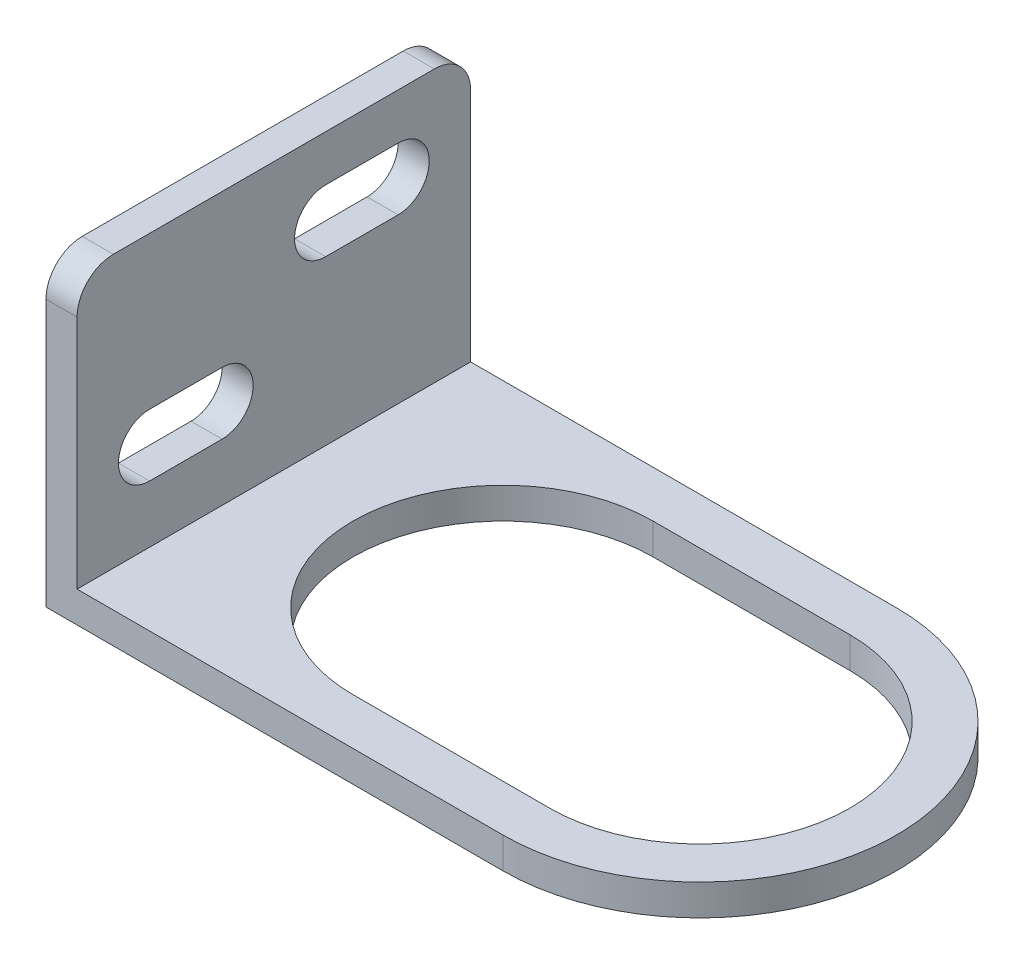
ISO-10303-21;
HEADER;
FILE_DESCRIPTION(('STEP AP214'),'2;1');
FILE_NAME('part.step','',(''),(''),'','','');
FILE_SCHEMA(('AUTOMOTIVE_DESIGN { 1 0 10303 214 1 1 1 1 }'));
ENDSEC;
DATA;
#1=APPLICATION_CONTEXT('core data for automotive mechanical design processes');
#2=APPLICATION_PROTOCOL_DEFINITION('international standard','automotive_design',2000,#1);
#3=PRODUCT_CONTEXT('',#1,'mechanical');
#4=PRODUCT('Part','Part','',(#3));
#5=PRODUCT_RELATED_PRODUCT_CATEGORY('part','',(#4));
#6=PRODUCT_DEFINITION_FORMATION('','',#4);
#7=PRODUCT_DEFINITION_CONTEXT('part definition',#1,'design');
#8=PRODUCT_DEFINITION('design','',#6,#7);
#9=PRODUCT_DEFINITION_SHAPE('','',#8);
#10=(LENGTH_UNIT() NAMED_UNIT(*) SI_UNIT(.MILLI.,.METRE.));
#11=(NAMED_UNIT(*) PLANE_ANGLE_UNIT() SI_UNIT($,.RADIAN.));
#12=(NAMED_UNIT(*) SI_UNIT($,.STERADIAN.) SOLID_ANGLE_UNIT());
#13=UNCERTAINTY_MEASURE_WITH_UNIT(LENGTH_MEASURE(1.E-05),#10,'distance_accuracy_value','');
#14=(GEOMETRIC_REPRESENTATION_CONTEXT(3) GLOBAL_UNCERTAINTY_ASSIGNED_CONTEXT((#13)) GLOBAL_UNIT_ASSIGNED_CONTEXT((#10,
#11,#12)) REPRESENTATION_CONTEXT('',''));
#15=CARTESIAN_POINT('',(0.,0.,0.));
#16=DIRECTION('',(0.,0.,1.));
#17=DIRECTION('',(1.,0.,0.));
#18=AXIS2_PLACEMENT_3D('',#15,#16,#17);
#19=CARTESIAN_POINT('',(0.,0.,19.));
#20=DIRECTION('',(0.,0.,-1.));
#21=DIRECTION('',(-1.,0.,0.));
#22=AXIS2_PLACEMENT_3D('',#19,#20,#21);
#23=PLANE('',#22);
#24=DIRECTION('',(0.,1.,0.));
#25=VECTOR('',#24,1.);
#26=CARTESIAN_POINT('',(42.625671960899,-8.5,19.));
#27=LINE('',#26,#25);
#28=CARTESIAN_POINT('',(42.625671960899,-1.5,19.));
#29=VERTEX_POINT('',#28);
#30=CARTESIAN_POINT('',(42.625671960899,1.5,19.));
#31=VERTEX_POINT('',#30);
#32=EDGE_CURVE('E183',#29,#31,#27,.T.);
#33=ORIENTED_EDGE('',*,*,#32,.T.);
#34=DIRECTION('',(1.,0.,0.));
#35=VECTOR('',#34,1.);
#36=CARTESIAN_POINT('',(0.,1.5,19.));
#37=LINE('',#36,#35);
#38=CARTESIAN_POINT('',(1.5,1.5,19.));
#39=VERTEX_POINT('',#38);
#40=EDGE_CURVE('E182',#39,#31,#37,.T.);
#41=ORIENTED_EDGE('',*,*,#40,.F.);
#42=DIRECTION('',(0.,-1.,0.));
#43=VECTOR('',#42,1.);
#44=CARTESIAN_POINT('',(1.5,32.,19.));
#45=LINE('',#44,#43);
#46=CARTESIAN_POINT('',(1.5,24.2461484812615,19.));
#47=VERTEX_POINT('',#46);
#48=EDGE_CURVE('E209',#47,#39,#45,.T.);
#49=ORIENTED_EDGE('',*,*,#48,.F.);
#50=DIRECTION('',(1.,0.,0.));
#51=VECTOR('',#50,1.);
#52=CARTESIAN_POINT('',(-1.5,24.2461484812615,19.));
#53=LINE('',#52,#51);
#54=CARTESIAN_POINT('',(-1.5,24.2461484812615,19.));
#55=VERTEX_POINT('',#54);
#56=EDGE_CURVE('E220',#55,#47,#53,.T.);
#57=ORIENTED_EDGE('',*,*,#56,.F.);
#58=DIRECTION('',(0.,-1.,0.));
#59=VECTOR('',#58,1.);
#60=CARTESIAN_POINT('',(-1.5,32.,19.));
#61=LINE('',#60,#59);
#62=CARTESIAN_POINT('',(-1.5,-1.5,19.));
#63=VERTEX_POINT('',#62);
#64=EDGE_CURVE('E202',#55,#63,#61,.T.);
#65=ORIENTED_EDGE('',*,*,#64,.T.);
#66=DIRECTION('',(1.,0.,0.));
#67=VECTOR('',#66,1.);
#68=CARTESIAN_POINT('',(0.,-1.5,19.));
#69=LINE('',#68,#67);
#70=EDGE_CURVE('E199',#63,#29,#69,.T.);
#71=ORIENTED_EDGE('',*,*,#70,.T.);
#72=EDGE_LOOP('',(#33,#41,#49,#57,#65,#71));
#73=FACE_BOUND('',#72,.T.);
#74=ADVANCED_FACE('F33',(#73),#23,.F.);
#75=CARTESIAN_POINT('',(0.,0.,-19.));
#76=DIRECTION('',(0.,0.,-1.));
#77=DIRECTION('',(-1.,0.,0.));
#78=AXIS2_PLACEMENT_3D('',#75,#76,#77);
#79=PLANE('',#78);
#80=DIRECTION('',(1.,0.,0.));
#81=VECTOR('',#80,1.);
#82=CARTESIAN_POINT('',(0.,1.5,-19.));
#83=LINE('',#82,#81);
#84=CARTESIAN_POINT('',(1.5,1.5,-19.));
#85=VERTEX_POINT('',#84);
#86=CARTESIAN_POINT('',(42.625671960899,1.5,-19.));
#87=VERTEX_POINT('',#86);
#88=EDGE_CURVE('E180',#85,#87,#83,.T.);
#89=ORIENTED_EDGE('',*,*,#88,.T.);
#90=DIRECTION('',(0.,1.,0.));
#91=VECTOR('',#90,1.);
#92=CARTESIAN_POINT('',(42.625671960899,-8.5,-19.));
#93=LINE('',#92,#91);
#94=CARTESIAN_POINT('',(42.625671960899,-1.5,-19.));
#95=VERTEX_POINT('',#94);
#96=EDGE_CURVE('E11',#87,#95,#93,.F.);
#97=ORIENTED_EDGE('',*,*,#96,.T.);
#98=DIRECTION('',(1.,0.,0.));
#99=VECTOR('',#98,1.);
#100=CARTESIAN_POINT('',(0.,-1.5,-19.));
#101=LINE('',#100,#99);
#102=CARTESIAN_POINT('',(-1.5,-1.5,-19.));
#103=VERTEX_POINT('',#102);
#104=EDGE_CURVE('E190',#103,#95,#101,.T.);
#105=ORIENTED_EDGE('',*,*,#104,.F.);
#106=DIRECTION('',(0.,-1.,0.));
#107=VECTOR('',#106,1.);
#108=CARTESIAN_POINT('',(-1.5,32.,-19.));
#109=LINE('',#108,#107);
#110=CARTESIAN_POINT('',(-1.5,24.2461484812615,-19.));
#111=VERTEX_POINT('',#110);
#112=EDGE_CURVE('E192',#111,#103,#109,.T.);
#113=ORIENTED_EDGE('',*,*,#112,.F.);
#114=DIRECTION('',(1.,0.,0.));
#115=VECTOR('',#114,1.);
#116=CARTESIAN_POINT('',(-1.5,24.2461484812615,-19.));
#117=LINE('',#116,#115);
#118=CARTESIAN_POINT('',(1.5,24.2461484812615,-19.));
#119=VERTEX_POINT('',#118);
#120=EDGE_CURVE('E275',#111,#119,#117,.T.);
#121=ORIENTED_EDGE('',*,*,#120,.T.);
#122=DIRECTION('',(0.,-1.,0.));
#123=VECTOR('',#122,1.);
#124=CARTESIAN_POINT('',(1.5,32.,-19.));
#125=LINE('',#124,#123);
#126=EDGE_CURVE('E188',#119,#85,#125,.T.);
#127=ORIENTED_EDGE('',*,*,#126,.T.);
#128=EDGE_LOOP('',(#89,#97,#105,#113,#121,#127));
#129=FACE_BOUND('',#128,.T.);
#130=ADVANCED_FACE('F185',(#129),#79,.T.);
#131=CARTESIAN_POINT('',(0.,-1.5,19.));
#132=DIRECTION('',(0.,1.,0.));
#133=DIRECTION('',(0.,0.,1.));
#134=AXIS2_PLACEMENT_3D('',#131,#132,#133);
#135=PLANE('',#134);
#136=DIRECTION('',(1.,0.,0.));
#137=VECTOR('',#136,1.);
#138=CARTESIAN_POINT('',(0.,-1.5,14.5));
#139=LINE('',#138,#137);
#140=CARTESIAN_POINT('',(23.6256719608991,-1.5,14.5));
#141=VERTEX_POINT('',#140);
#142=CARTESIAN_POINT('',(42.6256719608991,-1.5,14.5));
#143=VERTEX_POINT('',#142);
#144=EDGE_CURVE('E255',#141,#143,#139,.T.);
#145=ORIENTED_EDGE('',*,*,#144,.T.);
#146=CARTESIAN_POINT('',(42.6256719608991,-1.5,0.));
#147=DIRECTION('',(0.,1.,0.));
#148=DIRECTION('',(0.,0.,1.));
#149=AXIS2_PLACEMENT_3D('',#146,#147,#148);
#150=CIRCLE('',#149,14.5);
#151=CARTESIAN_POINT('',(42.6256719608991,-1.5,-14.5));
#152=VERTEX_POINT('',#151);
#153=EDGE_CURVE('E258',#143,#152,#150,.T.);
#154=ORIENTED_EDGE('',*,*,#153,.T.);
#155=DIRECTION('',(-1.,0.,0.));
#156=VECTOR('',#155,1.);
#157=CARTESIAN_POINT('',(0.,-1.5,-14.5));
#158=LINE('',#157,#156);
#159=CARTESIAN_POINT('',(23.6256719608991,-1.5,-14.5));
#160=VERTEX_POINT('',#159);
#161=EDGE_CURVE('E244',#152,#160,#158,.T.);
#162=ORIENTED_EDGE('',*,*,#161,.T.);
#163=CARTESIAN_POINT('',(23.6256719608991,-1.5,0.));
#164=DIRECTION('',(0.,1.,0.));
#165=DIRECTION('',(0.,0.,1.));
#166=AXIS2_PLACEMENT_3D('',#163,#164,#165);
#167=CIRCLE('',#166,14.5);
#168=EDGE_CURVE('E252',#160,#141,#167,.T.);
#169=ORIENTED_EDGE('',*,*,#168,.T.);
#170=EDGE_LOOP('',(#145,#154,#162,#169));
#171=FACE_BOUND('',#170,.T.);
#172=ORIENTED_EDGE('',*,*,#104,.T.);
#173=CARTESIAN_POINT('',(42.625671960899,-1.5,0.));
#174=DIRECTION('',(0.,1.,0.));
#175=DIRECTION('',(0.,0.,1.));
#176=AXIS2_PLACEMENT_3D('',#173,#174,#175);
#177=CIRCLE('',#176,19.);
#178=EDGE_CURVE('E48',#95,#29,#177,.F.);
#179=ORIENTED_EDGE('',*,*,#178,.T.);
#180=ORIENTED_EDGE('',*,*,#70,.F.);
#181=DIRECTION('',(0.,0.,-1.));
#182=VECTOR('',#181,1.);
#183=CARTESIAN_POINT('',(-1.5,-1.5,19.));
#184=LINE('',#183,#182);
#185=EDGE_CURVE('E200',#63,#103,#184,.T.);
#186=ORIENTED_EDGE('',*,*,#185,.T.);
#187=EDGE_LOOP('',(#172,#179,#180,#186));
#188=FACE_BOUND('',#187,.T.);
#189=ADVANCED_FACE('F35',(#171,#188),#135,.F.);
#190=CARTESIAN_POINT('',(0.,1.5,19.));
#191=DIRECTION('',(0.,1.,0.));
#192=DIRECTION('',(0.,0.,1.));
#193=AXIS2_PLACEMENT_3D('',#190,#191,#192);
#194=PLANE('',#193);
#195=CARTESIAN_POINT('',(42.625671960899,1.5,0.));
#196=DIRECTION('',(0.,-1.,0.));
#197=DIRECTION('',(0.,0.,-1.));
#198=AXIS2_PLACEMENT_3D('',#195,#196,#197);
#199=CIRCLE('',#198,19.);
#200=EDGE_CURVE('E168',#87,#31,#199,.T.);
#201=ORIENTED_EDGE('',*,*,#200,.F.);
#202=ORIENTED_EDGE('',*,*,#88,.F.);
#203=DIRECTION('',(0.,0.,-1.));
#204=VECTOR('',#203,1.);
#205=CARTESIAN_POINT('',(1.5,1.5,19.));
#206=LINE('',#205,#204);
#207=EDGE_CURVE('E41',#39,#85,#206,.T.);
#208=ORIENTED_EDGE('',*,*,#207,.F.);
#209=ORIENTED_EDGE('',*,*,#40,.T.);
#210=EDGE_LOOP('',(#201,#202,#208,#209));
#211=FACE_BOUND('',#210,.T.);
#212=CARTESIAN_POINT('',(42.6256719608991,1.5,0.));
#213=DIRECTION('',(0.,1.,0.));
#214=DIRECTION('',(0.,0.,1.));
#215=AXIS2_PLACEMENT_3D('',#212,#213,#214);
#216=CIRCLE('',#215,14.5);
#217=CARTESIAN_POINT('',(42.6256719608991,1.5,14.5));
#218=VERTEX_POINT('',#217);
#219=CARTESIAN_POINT('',(42.6256719608991,1.5,-14.5));
#220=VERTEX_POINT('',#219);
#221=EDGE_CURVE('E228',#218,#220,#216,.T.);
#222=ORIENTED_EDGE('',*,*,#221,.F.);
#223=DIRECTION('',(1.,0.,0.));
#224=VECTOR('',#223,1.);
#225=CARTESIAN_POINT('',(42.6256719608991,1.5,14.5));
#226=LINE('',#225,#224);
#227=CARTESIAN_POINT('',(23.6256719608991,1.5,14.5));
#228=VERTEX_POINT('',#227);
#229=EDGE_CURVE('E238',#228,#218,#226,.T.);
#230=ORIENTED_EDGE('',*,*,#229,.F.);
#231=CARTESIAN_POINT('',(23.6256719608991,1.5,0.));
#232=DIRECTION('',(0.,1.,0.));
#233=DIRECTION('',(0.,0.,1.));
#234=AXIS2_PLACEMENT_3D('',#231,#232,#233);
#235=CIRCLE('',#234,14.5);
#236=CARTESIAN_POINT('',(23.6256719608991,1.5,-14.5));
#237=VERTEX_POINT('',#236);
#238=EDGE_CURVE('E235',#237,#228,#235,.T.);
#239=ORIENTED_EDGE('',*,*,#238,.F.);
#240=DIRECTION('',(-1.,0.,0.));
#241=VECTOR('',#240,1.);
#242=CARTESIAN_POINT('',(42.6256719608991,1.5,-14.5));
#243=LINE('',#242,#241);
#244=EDGE_CURVE('E230',#220,#237,#243,.T.);
#245=ORIENTED_EDGE('',*,*,#244,.F.);
#246=EDGE_LOOP('',(#222,#230,#239,#245));
#247=FACE_BOUND('',#246,.T.);
#248=ADVANCED_FACE('F177',(#211,#247),#194,.T.);
#249=CARTESIAN_POINT('',(1.5,32.,19.));
#250=DIRECTION('',(1.,0.,0.));
#251=DIRECTION('',(0.,1.,0.));
#252=AXIS2_PLACEMENT_3D('',#249,#250,#251);
#253=PLANE('',#252);
#254=CARTESIAN_POINT('',(1.5,24.2461484812615,-15.4965376918515));
#255=DIRECTION('',(-1.,0.,0.));
#256=DIRECTION('',(0.,1.,0.));
#257=AXIS2_PLACEMENT_3D('',#254,#255,#256);
#258=CIRCLE('',#257,3.50346230814845);
#259=CARTESIAN_POINT('',(1.5,27.74961078941,-15.4965376918515));
#260=VERTEX_POINT('',#259);
#261=EDGE_CURVE('E265',#260,#119,#258,.T.);
#262=ORIENTED_EDGE('',*,*,#261,.F.);
#263=DIRECTION('',(0.,0.,-1.));
#264=VECTOR('',#263,1.);
#265=CARTESIAN_POINT('',(1.5,27.74961078941,15.4965376918515));
#266=LINE('',#265,#264);
#267=CARTESIAN_POINT('',(1.5,27.74961078941,15.4965376918515));
#268=VERTEX_POINT('',#267);
#269=EDGE_CURVE('E271',#268,#260,#266,.T.);
#270=ORIENTED_EDGE('',*,*,#269,.F.);
#271=CARTESIAN_POINT('',(1.5,24.2461484812615,15.4965376918515));
#272=DIRECTION('',(-1.,0.,0.));
#273=DIRECTION('',(0.,-1.,0.));
#274=AXIS2_PLACEMENT_3D('',#271,#272,#273);
#275=CIRCLE('',#274,3.50346230814845);
#276=EDGE_CURVE('E261',#47,#268,#275,.T.);
#277=ORIENTED_EDGE('',*,*,#276,.F.);
#278=ORIENTED_EDGE('',*,*,#48,.T.);
#279=ORIENTED_EDGE('',*,*,#207,.T.);
#280=ORIENTED_EDGE('',*,*,#126,.F.);
#281=EDGE_LOOP('',(#262,#270,#277,#278,#279,#280));
#282=FACE_BOUND('',#281,.T.);
#283=CARTESIAN_POINT('',(1.5,10.0399290298854,12.));
#284=DIRECTION('',(1.,0.,0.));
#285=DIRECTION('',(0.,1.,0.));
#286=AXIS2_PLACEMENT_3D('',#283,#284,#285);
#287=CIRCLE('',#286,3.);
#288=CARTESIAN_POINT('',(1.5,13.0399290298854,12.));
#289=VERTEX_POINT('',#288);
#290=CARTESIAN_POINT('',(1.5,7.03992902988541,12.));
#291=VERTEX_POINT('',#290);
#292=EDGE_CURVE('E277',#289,#291,#287,.T.);
#293=ORIENTED_EDGE('',*,*,#292,.F.);
#294=DIRECTION('',(0.,0.,1.));
#295=VECTOR('',#294,1.);
#296=CARTESIAN_POINT('',(1.5,13.0399290298854,12.));
#297=LINE('',#296,#295);
#298=CARTESIAN_POINT('',(1.5,13.0399290298854,5.));
#299=VERTEX_POINT('',#298);
#300=EDGE_CURVE('E287',#299,#289,#297,.T.);
#301=ORIENTED_EDGE('',*,*,#300,.F.);
#302=CARTESIAN_POINT('',(1.5,10.0399290298854,5.));
#303=DIRECTION('',(1.,0.,0.));
#304=DIRECTION('',(0.,1.,0.));
#305=AXIS2_PLACEMENT_3D('',#302,#303,#304);
#306=CIRCLE('',#305,3.);
#307=CARTESIAN_POINT('',(1.5,7.03992902988541,5.));
#308=VERTEX_POINT('',#307);
#309=EDGE_CURVE('E301',#308,#299,#306,.T.);
#310=ORIENTED_EDGE('',*,*,#309,.F.);
#311=DIRECTION('',(0.,0.,-1.));
#312=VECTOR('',#311,1.);
#313=CARTESIAN_POINT('',(1.5,7.03992902988541,12.));
#314=LINE('',#313,#312);
#315=EDGE_CURVE('E298',#291,#308,#314,.T.);
#316=ORIENTED_EDGE('',*,*,#315,.F.);
#317=EDGE_LOOP('',(#293,#301,#310,#316));
#318=FACE_BOUND('',#317,.T.);
#319=CARTESIAN_POINT('',(1.5,20.2986080282293,-5.));
#320=DIRECTION('',(1.,0.,0.));
#321=DIRECTION('',(0.,1.,0.));
#322=AXIS2_PLACEMENT_3D('',#319,#320,#321);
#323=CIRCLE('',#322,3.);
#324=CARTESIAN_POINT('',(1.5,23.2986080282293,-5.));
#325=VERTEX_POINT('',#324);
#326=CARTESIAN_POINT('',(1.5,17.2986080282293,-5.));
#327=VERTEX_POINT('',#326);
#328=EDGE_CURVE('E308',#325,#327,#323,.T.);
#329=ORIENTED_EDGE('',*,*,#328,.F.);
#330=DIRECTION('',(0.,0.,1.));
#331=VECTOR('',#330,1.);
#332=CARTESIAN_POINT('',(1.5,23.2986080282293,-5.));
#333=LINE('',#332,#331);
#334=CARTESIAN_POINT('',(1.5,23.2986080282293,-12.));
#335=VERTEX_POINT('',#334);
#336=EDGE_CURVE('E319',#335,#325,#333,.T.);
#337=ORIENTED_EDGE('',*,*,#336,.F.);
#338=CARTESIAN_POINT('',(1.5,20.2986080282293,-12.));
#339=DIRECTION('',(1.,0.,0.));
#340=DIRECTION('',(0.,1.,0.));
#341=AXIS2_PLACEMENT_3D('',#338,#339,#340);
#342=CIRCLE('',#341,3.);
#343=CARTESIAN_POINT('',(1.5,17.2986080282293,-12.));
#344=VERTEX_POINT('',#343);
#345=EDGE_CURVE('E333',#344,#335,#342,.T.);
#346=ORIENTED_EDGE('',*,*,#345,.F.);
#347=DIRECTION('',(0.,0.,-1.));
#348=VECTOR('',#347,1.);
#349=CARTESIAN_POINT('',(1.5,17.2986080282293,-5.));
#350=LINE('',#349,#348);
#351=EDGE_CURVE('E330',#327,#344,#350,.T.);
#352=ORIENTED_EDGE('',*,*,#351,.F.);
#353=EDGE_LOOP('',(#329,#337,#346,#352));
#354=FACE_BOUND('',#353,.T.);
#355=ADVANCED_FACE('F205',(#282,#318,#354),#253,.T.);
#356=CARTESIAN_POINT('',(-1.5,32.,19.));
#357=DIRECTION('',(1.,0.,0.));
#358=DIRECTION('',(0.,1.,0.));
#359=AXIS2_PLACEMENT_3D('',#356,#357,#358);
#360=PLANE('',#359);
#361=DIRECTION('',(0.,0.,1.));
#362=VECTOR('',#361,1.);
#363=CARTESIAN_POINT('',(-1.5,13.0399290298854,12.));
#364=LINE('',#363,#362);
#365=CARTESIAN_POINT('',(-1.5,13.0399290298854,5.));
#366=VERTEX_POINT('',#365);
#367=CARTESIAN_POINT('',(-1.5,13.0399290298854,12.));
#368=VERTEX_POINT('',#367);
#369=EDGE_CURVE('E293',#366,#368,#364,.T.);
#370=ORIENTED_EDGE('',*,*,#369,.T.);
#371=CARTESIAN_POINT('',(-1.5,10.0399290298854,12.));
#372=DIRECTION('',(1.,0.,0.));
#373=DIRECTION('',(0.,1.,0.));
#374=AXIS2_PLACEMENT_3D('',#371,#372,#373);
#375=CIRCLE('',#374,3.);
#376=CARTESIAN_POINT('',(-1.5,7.03992902988541,12.));
#377=VERTEX_POINT('',#376);
#378=EDGE_CURVE('E283',#368,#377,#375,.T.);
#379=ORIENTED_EDGE('',*,*,#378,.T.);
#380=DIRECTION('',(0.,0.,-1.));
#381=VECTOR('',#380,1.);
#382=CARTESIAN_POINT('',(-1.5,7.03992902988541,12.));
#383=LINE('',#382,#381);
#384=CARTESIAN_POINT('',(-1.5,7.03992902988541,5.));
#385=VERTEX_POINT('',#384);
#386=EDGE_CURVE('E286',#377,#385,#383,.T.);
#387=ORIENTED_EDGE('',*,*,#386,.T.);
#388=CARTESIAN_POINT('',(-1.5,10.0399290298854,5.));
#389=DIRECTION('',(1.,0.,0.));
#390=DIRECTION('',(0.,1.,0.));
#391=AXIS2_PLACEMENT_3D('',#388,#389,#390);
#392=CIRCLE('',#391,3.);
#393=EDGE_CURVE('E290',#385,#366,#392,.T.);
#394=ORIENTED_EDGE('',*,*,#393,.T.);
#395=EDGE_LOOP('',(#370,#379,#387,#394));
#396=FACE_BOUND('',#395,.T.);
#397=DIRECTION('',(0.,0.,1.));
#398=VECTOR('',#397,1.);
#399=CARTESIAN_POINT('',(-1.5,23.2986080282293,-5.));
#400=LINE('',#399,#398);
#401=CARTESIAN_POINT('',(-1.5,23.2986080282293,-12.));
#402=VERTEX_POINT('',#401);
#403=CARTESIAN_POINT('',(-1.5,23.2986080282293,-5.));
#404=VERTEX_POINT('',#403);
#405=EDGE_CURVE('E325',#402,#404,#400,.T.);
#406=ORIENTED_EDGE('',*,*,#405,.T.);
#407=CARTESIAN_POINT('',(-1.5,20.2986080282293,-5.));
#408=DIRECTION('',(1.,0.,0.));
#409=DIRECTION('',(0.,1.,0.));
#410=AXIS2_PLACEMENT_3D('',#407,#408,#409);
#411=CIRCLE('',#410,3.);
#412=CARTESIAN_POINT('',(-1.5,17.2986080282293,-5.));
#413=VERTEX_POINT('',#412);
#414=EDGE_CURVE('E315',#404,#413,#411,.T.);
#415=ORIENTED_EDGE('',*,*,#414,.T.);
#416=DIRECTION('',(0.,0.,-1.));
#417=VECTOR('',#416,1.);
#418=CARTESIAN_POINT('',(-1.5,17.2986080282293,-5.));
#419=LINE('',#418,#417);
#420=CARTESIAN_POINT('',(-1.5,17.2986080282293,-12.));
#421=VERTEX_POINT('',#420);
#422=EDGE_CURVE('E318',#413,#421,#419,.T.);
#423=ORIENTED_EDGE('',*,*,#422,.T.);
#424=CARTESIAN_POINT('',(-1.5,20.2986080282293,-12.));
#425=DIRECTION('',(1.,0.,0.));
#426=DIRECTION('',(0.,1.,0.));
#427=AXIS2_PLACEMENT_3D('',#424,#425,#426);
#428=CIRCLE('',#427,3.);
#429=EDGE_CURVE('E322',#421,#402,#428,.T.);
#430=ORIENTED_EDGE('',*,*,#429,.T.);
#431=EDGE_LOOP('',(#406,#415,#423,#430));
#432=FACE_BOUND('',#431,.T.);
#433=DIRECTION('',(0.,0.,-1.));
#434=VECTOR('',#433,1.);
#435=CARTESIAN_POINT('',(-1.5,27.74961078941,15.4965376918515));
#436=LINE('',#435,#434);
#437=CARTESIAN_POINT('',(-1.5,27.74961078941,15.4965376918515));
#438=VERTEX_POINT('',#437);
#439=CARTESIAN_POINT('',(-1.5,27.74961078941,-15.4965376918515));
#440=VERTEX_POINT('',#439);
#441=EDGE_CURVE('E264',#438,#440,#436,.T.);
#442=ORIENTED_EDGE('',*,*,#441,.T.);
#443=CARTESIAN_POINT('',(-1.5,24.2461484812615,-15.4965376918515));
#444=DIRECTION('',(-1.,0.,0.));
#445=DIRECTION('',(0.,1.,0.));
#446=AXIS2_PLACEMENT_3D('',#443,#444,#445);
#447=CIRCLE('',#446,3.50346230814845);
#448=EDGE_CURVE('E267',#440,#111,#447,.T.);
#449=ORIENTED_EDGE('',*,*,#448,.T.);
#450=ORIENTED_EDGE('',*,*,#112,.T.);
#451=ORIENTED_EDGE('',*,*,#185,.F.);
#452=ORIENTED_EDGE('',*,*,#64,.F.);
#453=CARTESIAN_POINT('',(-1.5,24.2461484812615,15.4965376918515));
#454=DIRECTION('',(-1.,0.,0.));
#455=DIRECTION('',(0.,-1.,0.));
#456=AXIS2_PLACEMENT_3D('',#453,#454,#455);
#457=CIRCLE('',#456,3.50346230814845);
#458=EDGE_CURVE('E262',#55,#438,#457,.T.);
#459=ORIENTED_EDGE('',*,*,#458,.T.);
#460=EDGE_LOOP('',(#442,#449,#450,#451,#452,#459));
#461=FACE_BOUND('',#460,.T.);
#462=ADVANCED_FACE('F224',(#396,#432,#461),#360,.F.);
#463=CARTESIAN_POINT('',(-1.5,20.2986080282293,-5.));
#464=DIRECTION('',(1.,0.,0.));
#465=DIRECTION('',(0.,1.,0.));
#466=AXIS2_PLACEMENT_3D('',#463,#464,#465);
#467=CYLINDRICAL_SURFACE('',#466,3.);
#468=ORIENTED_EDGE('',*,*,#328,.T.);
#469=DIRECTION('',(1.,0.,0.));
#470=VECTOR('',#469,1.);
#471=CARTESIAN_POINT('',(-1.5,17.2986080282293,-5.));
#472=LINE('',#471,#470);
#473=EDGE_CURVE('E328',#413,#327,#472,.T.);
#474=ORIENTED_EDGE('',*,*,#473,.F.);
#475=ORIENTED_EDGE('',*,*,#414,.F.);
#476=DIRECTION('',(1.,0.,0.));
#477=VECTOR('',#476,1.);
#478=CARTESIAN_POINT('',(-1.5,23.2986080282293,-5.));
#479=LINE('',#478,#477);
#480=EDGE_CURVE('E194',#404,#325,#479,.T.);
#481=ORIENTED_EDGE('',*,*,#480,.T.);
#482=EDGE_LOOP('',(#468,#474,#475,#481));
#483=FACE_BOUND('',#482,.T.);
#484=ADVANCED_FACE('F358',(#483),#467,.F.);
#485=CARTESIAN_POINT('',(-1.5,23.2986080282293,-5.));
#486=DIRECTION('',(0.,1.,0.));
#487=DIRECTION('',(0.,0.,1.));
#488=AXIS2_PLACEMENT_3D('',#485,#486,#487);
#489=PLANE('',#488);
#490=ORIENTED_EDGE('',*,*,#336,.T.);
#491=ORIENTED_EDGE('',*,*,#480,.F.);
#492=ORIENTED_EDGE('',*,*,#405,.F.);
#493=DIRECTION('',(1.,0.,0.));
#494=VECTOR('',#493,1.);
#495=CARTESIAN_POINT('',(-1.5,23.2986080282293,-12.));
#496=LINE('',#495,#494);
#497=EDGE_CURVE('E339',#402,#335,#496,.T.);
#498=ORIENTED_EDGE('',*,*,#497,.T.);
#499=EDGE_LOOP('',(#490,#491,#492,#498));
#500=FACE_BOUND('',#499,.T.);
#501=ADVANCED_FACE('F360',(#500),#489,.F.);
#502=CARTESIAN_POINT('',(-1.5,20.2986080282293,-12.));
#503=DIRECTION('',(1.,0.,0.));
#504=DIRECTION('',(0.,1.,0.));
#505=AXIS2_PLACEMENT_3D('',#502,#503,#504);
#506=CYLINDRICAL_SURFACE('',#505,3.);
#507=ORIENTED_EDGE('',*,*,#345,.T.);
#508=ORIENTED_EDGE('',*,*,#497,.F.);
#509=ORIENTED_EDGE('',*,*,#429,.F.);
#510=DIRECTION('',(1.,0.,0.));
#511=VECTOR('',#510,1.);
#512=CARTESIAN_POINT('',(-1.5,17.2986080282293,-12.));
#513=LINE('',#512,#511);
#514=EDGE_CURVE('E341',#421,#344,#513,.T.);
#515=ORIENTED_EDGE('',*,*,#514,.T.);
#516=EDGE_LOOP('',(#507,#508,#509,#515));
#517=FACE_BOUND('',#516,.T.);
#518=ADVANCED_FACE('F355',(#517),#506,.F.);
#519=CARTESIAN_POINT('',(-1.5,17.2986080282293,-5.));
#520=DIRECTION('',(0.,-1.,0.));
#521=DIRECTION('',(0.,0.,-1.));
#522=AXIS2_PLACEMENT_3D('',#519,#520,#521);
#523=PLANE('',#522);
#524=ORIENTED_EDGE('',*,*,#351,.T.);
#525=ORIENTED_EDGE('',*,*,#514,.F.);
#526=ORIENTED_EDGE('',*,*,#422,.F.);
#527=ORIENTED_EDGE('',*,*,#473,.T.);
#528=EDGE_LOOP('',(#524,#525,#526,#527));
#529=FACE_BOUND('',#528,.T.);
#530=ADVANCED_FACE('F346',(#529),#523,.F.);
#531=CARTESIAN_POINT('',(-1.5,10.0399290298854,12.));
#532=DIRECTION('',(1.,0.,0.));
#533=DIRECTION('',(0.,1.,0.));
#534=AXIS2_PLACEMENT_3D('',#531,#532,#533);
#535=CYLINDRICAL_SURFACE('',#534,3.);
#536=ORIENTED_EDGE('',*,*,#292,.T.);
#537=DIRECTION('',(1.,0.,0.));
#538=VECTOR('',#537,1.);
#539=CARTESIAN_POINT('',(-1.5,7.03992902988541,12.));
#540=LINE('',#539,#538);
#541=EDGE_CURVE('E296',#377,#291,#540,.T.);
#542=ORIENTED_EDGE('',*,*,#541,.F.);
#543=ORIENTED_EDGE('',*,*,#378,.F.);
#544=DIRECTION('',(1.,0.,0.));
#545=VECTOR('',#544,1.);
#546=CARTESIAN_POINT('',(-1.5,13.0399290298854,12.));
#547=LINE('',#546,#545);
#548=EDGE_CURVE('E306',#368,#289,#547,.T.);
#549=ORIENTED_EDGE('',*,*,#548,.T.);
#550=EDGE_LOOP('',(#536,#542,#543,#549));
#551=FACE_BOUND('',#550,.T.);
#552=ADVANCED_FACE('F432',(#551),#535,.F.);
#553=CARTESIAN_POINT('',(-1.5,13.0399290298854,12.));
#554=DIRECTION('',(0.,1.,0.));
#555=DIRECTION('',(0.,0.,1.));
#556=AXIS2_PLACEMENT_3D('',#553,#554,#555);
#557=PLANE('',#556);
#558=ORIENTED_EDGE('',*,*,#300,.T.);
#559=ORIENTED_EDGE('',*,*,#548,.F.);
#560=ORIENTED_EDGE('',*,*,#369,.F.);
#561=DIRECTION('',(1.,0.,0.));
#562=VECTOR('',#561,1.);
#563=CARTESIAN_POINT('',(-1.5,13.0399290298854,5.));
#564=LINE('',#563,#562);
#565=EDGE_CURVE('E309',#366,#299,#564,.T.);
#566=ORIENTED_EDGE('',*,*,#565,.T.);
#567=EDGE_LOOP('',(#558,#559,#560,#566));
#568=FACE_BOUND('',#567,.T.);
#569=ADVANCED_FACE('F428',(#568),#557,.F.);
#570=CARTESIAN_POINT('',(-1.5,10.0399290298854,5.));
#571=DIRECTION('',(1.,0.,0.));
#572=DIRECTION('',(0.,1.,0.));
#573=AXIS2_PLACEMENT_3D('',#570,#571,#572);
#574=CYLINDRICAL_SURFACE('',#573,3.);
#575=ORIENTED_EDGE('',*,*,#309,.T.);
#576=ORIENTED_EDGE('',*,*,#565,.F.);
#577=ORIENTED_EDGE('',*,*,#393,.F.);
#578=DIRECTION('',(1.,0.,0.));
#579=VECTOR('',#578,1.);
#580=CARTESIAN_POINT('',(-1.5,7.03992902988541,5.));
#581=LINE('',#580,#579);
#582=EDGE_CURVE('E311',#385,#308,#581,.T.);
#583=ORIENTED_EDGE('',*,*,#582,.T.);
#584=EDGE_LOOP('',(#575,#576,#577,#583));
#585=FACE_BOUND('',#584,.T.);
#586=ADVANCED_FACE('F431',(#585),#574,.F.);
#587=CARTESIAN_POINT('',(-1.5,7.03992902988541,12.));
#588=DIRECTION('',(0.,-1.,0.));
#589=DIRECTION('',(0.,0.,-1.));
#590=AXIS2_PLACEMENT_3D('',#587,#588,#589);
#591=PLANE('',#590);
#592=ORIENTED_EDGE('',*,*,#315,.T.);
#593=ORIENTED_EDGE('',*,*,#582,.F.);
#594=ORIENTED_EDGE('',*,*,#386,.F.);
#595=ORIENTED_EDGE('',*,*,#541,.T.);
#596=EDGE_LOOP('',(#592,#593,#594,#595));
#597=FACE_BOUND('',#596,.T.);
#598=ADVANCED_FACE('F420',(#597),#591,.F.);
#599=CARTESIAN_POINT('',(-1.5,24.2461484812615,-15.4965376918515));
#600=DIRECTION('',(1.,0.,0.));
#601=DIRECTION('',(0.,1.,0.));
#602=AXIS2_PLACEMENT_3D('',#599,#600,#601);
#603=CYLINDRICAL_SURFACE('',#602,3.50346230814845);
#604=ORIENTED_EDGE('',*,*,#261,.T.);
#605=ORIENTED_EDGE('',*,*,#120,.F.);
#606=ORIENTED_EDGE('',*,*,#448,.F.);
#607=DIRECTION('',(1.,0.,0.));
#608=VECTOR('',#607,1.);
#609=CARTESIAN_POINT('',(-1.5,27.74961078941,-15.4965376918515));
#610=LINE('',#609,#608);
#611=EDGE_CURVE('E278',#440,#260,#610,.T.);
#612=ORIENTED_EDGE('',*,*,#611,.T.);
#613=EDGE_LOOP('',(#604,#605,#606,#612));
#614=FACE_BOUND('',#613,.T.);
#615=ADVANCED_FACE('F416',(#614),#603,.T.);
#616=CARTESIAN_POINT('',(-1.5,27.74961078941,15.4965376918515));
#617=DIRECTION('',(0.,-1.,0.));
#618=DIRECTION('',(0.,0.,-1.));
#619=AXIS2_PLACEMENT_3D('',#616,#617,#618);
#620=PLANE('',#619);
#621=ORIENTED_EDGE('',*,*,#269,.T.);
#622=ORIENTED_EDGE('',*,*,#611,.F.);
#623=ORIENTED_EDGE('',*,*,#441,.F.);
#624=DIRECTION('',(1.,0.,0.));
#625=VECTOR('',#624,1.);
#626=CARTESIAN_POINT('',(-1.5,27.74961078941,15.4965376918515));
#627=LINE('',#626,#625);
#628=EDGE_CURVE('E280',#438,#268,#627,.T.);
#629=ORIENTED_EDGE('',*,*,#628,.T.);
#630=EDGE_LOOP('',(#621,#622,#623,#629));
#631=FACE_BOUND('',#630,.T.);
#632=ADVANCED_FACE('F419',(#631),#620,.F.);
#633=CARTESIAN_POINT('',(-1.5,24.2461484812615,15.4965376918515));
#634=DIRECTION('',(1.,0.,0.));
#635=DIRECTION('',(0.,1.,0.));
#636=AXIS2_PLACEMENT_3D('',#633,#634,#635);
#637=CYLINDRICAL_SURFACE('',#636,3.50346230814845);
#638=ORIENTED_EDGE('',*,*,#276,.T.);
#639=ORIENTED_EDGE('',*,*,#628,.F.);
#640=ORIENTED_EDGE('',*,*,#458,.F.);
#641=ORIENTED_EDGE('',*,*,#56,.T.);
#642=EDGE_LOOP('',(#638,#639,#640,#641));
#643=FACE_BOUND('',#642,.T.);
#644=ADVANCED_FACE('F415',(#643),#637,.T.);
#645=CARTESIAN_POINT('',(42.6256719608991,-8.5,0.));
#646=DIRECTION('',(0.,1.,0.));
#647=DIRECTION('',(0.,0.,1.));
#648=AXIS2_PLACEMENT_3D('',#645,#646,#647);
#649=CYLINDRICAL_SURFACE('',#648,14.5);
#650=DIRECTION('',(0.,1.,0.));
#651=VECTOR('',#650,1.);
#652=CARTESIAN_POINT('',(42.6256719608991,-8.5,14.5));
#653=LINE('',#652,#651);
#654=EDGE_CURVE('E242',#143,#218,#653,.T.);
#655=ORIENTED_EDGE('',*,*,#654,.T.);
#656=ORIENTED_EDGE('',*,*,#221,.T.);
#657=DIRECTION('',(0.,1.,0.));
#658=VECTOR('',#657,1.);
#659=CARTESIAN_POINT('',(42.6256719608991,-8.5,-14.5));
#660=LINE('',#659,#658);
#661=EDGE_CURVE('E241',#152,#220,#660,.T.);
#662=ORIENTED_EDGE('',*,*,#661,.F.);
#663=ORIENTED_EDGE('',*,*,#153,.F.);
#664=EDGE_LOOP('',(#655,#656,#662,#663));
#665=FACE_BOUND('',#664,.T.);
#666=ADVANCED_FACE('F401',(#665),#649,.F.);
#667=CARTESIAN_POINT('',(42.6256719608991,-8.5,14.5));
#668=DIRECTION('',(0.,0.,1.));
#669=DIRECTION('',(1.,0.,0.));
#670=AXIS2_PLACEMENT_3D('',#667,#668,#669);
#671=PLANE('',#670);
#672=DIRECTION('',(0.,1.,0.));
#673=VECTOR('',#672,1.);
#674=CARTESIAN_POINT('',(23.6256719608991,-8.5,14.5));
#675=LINE('',#674,#673);
#676=EDGE_CURVE('E245',#141,#228,#675,.T.);
#677=ORIENTED_EDGE('',*,*,#676,.T.);
#678=ORIENTED_EDGE('',*,*,#229,.T.);
#679=ORIENTED_EDGE('',*,*,#654,.F.);
#680=ORIENTED_EDGE('',*,*,#144,.F.);
#681=EDGE_LOOP('',(#677,#678,#679,#680));
#682=FACE_BOUND('',#681,.T.);
#683=ADVANCED_FACE('F392',(#682),#671,.F.);
#684=CARTESIAN_POINT('',(23.6256719608991,-8.5,0.));
#685=DIRECTION('',(0.,1.,0.));
#686=DIRECTION('',(0.,0.,1.));
#687=AXIS2_PLACEMENT_3D('',#684,#685,#686);
#688=CYLINDRICAL_SURFACE('',#687,14.5);
#689=DIRECTION('',(0.,1.,0.));
#690=VECTOR('',#689,1.);
#691=CARTESIAN_POINT('',(23.6256719608991,-8.5,-14.5));
#692=LINE('',#691,#690);
#693=EDGE_CURVE('E55',#160,#237,#692,.T.);
#694=ORIENTED_EDGE('',*,*,#693,.T.);
#695=ORIENTED_EDGE('',*,*,#238,.T.);
#696=ORIENTED_EDGE('',*,*,#676,.F.);
#697=ORIENTED_EDGE('',*,*,#168,.F.);
#698=EDGE_LOOP('',(#694,#695,#696,#697));
#699=FACE_BOUND('',#698,.T.);
#700=ADVANCED_FACE('F394',(#699),#688,.F.);
#701=CARTESIAN_POINT('',(42.6256719608991,-8.5,-14.5));
#702=DIRECTION('',(0.,0.,-1.));
#703=DIRECTION('',(-1.,0.,0.));
#704=AXIS2_PLACEMENT_3D('',#701,#702,#703);
#705=PLANE('',#704);
#706=ORIENTED_EDGE('',*,*,#661,.T.);
#707=ORIENTED_EDGE('',*,*,#244,.T.);
#708=ORIENTED_EDGE('',*,*,#693,.F.);
#709=ORIENTED_EDGE('',*,*,#161,.F.);
#710=EDGE_LOOP('',(#706,#707,#708,#709));
#711=FACE_BOUND('',#710,.T.);
#712=ADVANCED_FACE('F402',(#711),#705,.F.);
#713=CARTESIAN_POINT('',(42.625671960899,-8.5,0.));
#714=DIRECTION('',(0.,1.,0.));
#715=DIRECTION('',(0.,0.,1.));
#716=AXIS2_PLACEMENT_3D('',#713,#714,#715);
#717=CYLINDRICAL_SURFACE('',#716,19.);
#718=ORIENTED_EDGE('',*,*,#96,.F.);
#719=ORIENTED_EDGE('',*,*,#200,.T.);
#720=ORIENTED_EDGE('',*,*,#32,.F.);
#721=ORIENTED_EDGE('',*,*,#178,.F.);
#722=EDGE_LOOP('',(#718,#719,#720,#721));
#723=FACE_BOUND('',#722,.T.);
#724=ADVANCED_FACE('F167',(#723),#717,.T.);
#725=CLOSED_SHELL('',(#74,#130,#189,#248,#355,#462,#484,#501,#518,#530,#552,#569,#586,#598,#615,
#632,#644,#666,#683,#700,#712,#724));
#726=MANIFOLD_SOLID_BREP('B2',#725);
#727=ADVANCED_BREP_SHAPE_REPRESENTATION('',(#18,#726),#14);
#728=SHAPE_DEFINITION_REPRESENTATION(#9,#727);
ENDSEC;
END-ISO-10303-21;
